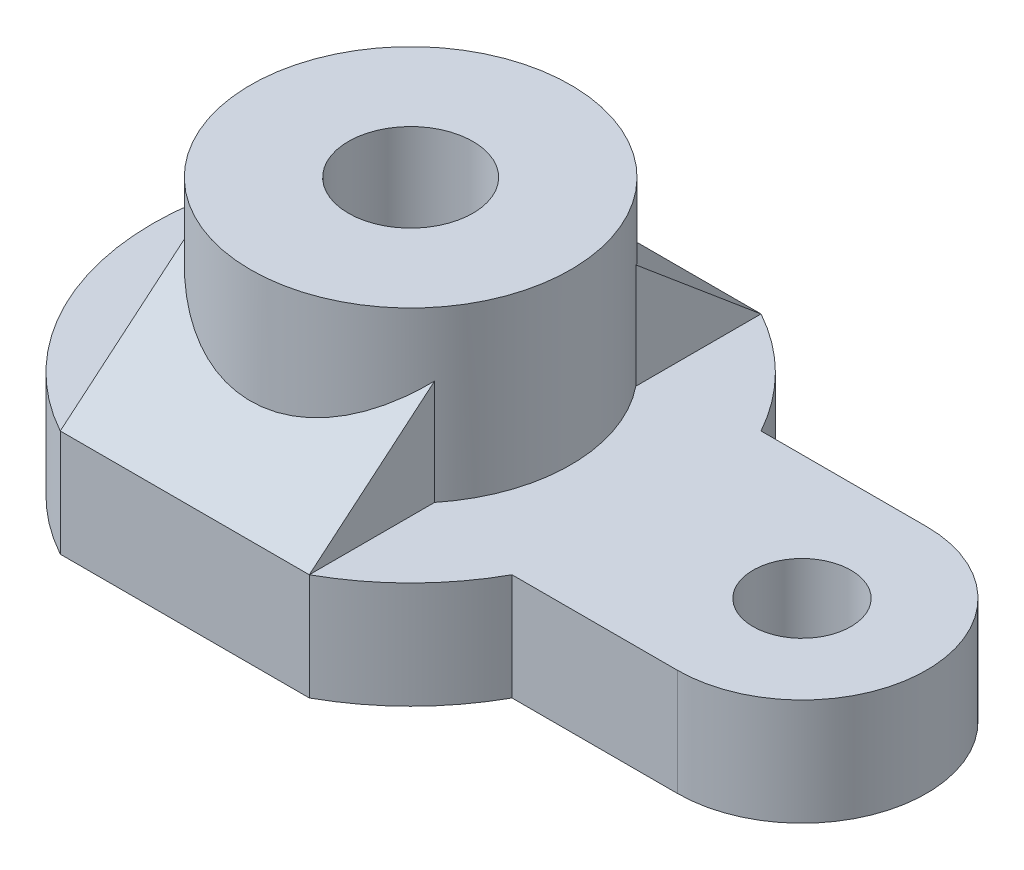
ISO-10303-21;
HEADER;
FILE_DESCRIPTION(('STEP AP214'),'2;1');
FILE_NAME('part.step','',(''),(''),'','','');
FILE_SCHEMA(('AUTOMOTIVE_DESIGN { 1 0 10303 214 1 1 1 1 }'));
ENDSEC;
DATA;
#1=APPLICATION_CONTEXT('core data for automotive mechanical design processes');
#2=APPLICATION_PROTOCOL_DEFINITION('international standard','automotive_design',2000,#1);
#3=PRODUCT_CONTEXT('',#1,'mechanical');
#4=PRODUCT('Part','Part','',(#3));
#5=PRODUCT_RELATED_PRODUCT_CATEGORY('part','',(#4));
#6=PRODUCT_DEFINITION_FORMATION('','',#4);
#7=PRODUCT_DEFINITION_CONTEXT('part definition',#1,'design');
#8=PRODUCT_DEFINITION('design','',#6,#7);
#9=PRODUCT_DEFINITION_SHAPE('','',#8);
#10=(LENGTH_UNIT() NAMED_UNIT(*) SI_UNIT(.MILLI.,.METRE.));
#11=(NAMED_UNIT(*) PLANE_ANGLE_UNIT() SI_UNIT($,.RADIAN.));
#12=(NAMED_UNIT(*) SI_UNIT($,.STERADIAN.) SOLID_ANGLE_UNIT());
#13=UNCERTAINTY_MEASURE_WITH_UNIT(LENGTH_MEASURE(1.E-05),#10,'distance_accuracy_value','');
#14=(GEOMETRIC_REPRESENTATION_CONTEXT(3) GLOBAL_UNCERTAINTY_ASSIGNED_CONTEXT((#13)) GLOBAL_UNIT_ASSIGNED_CONTEXT((#10,
#11,#12)) REPRESENTATION_CONTEXT('',''));
#15=CARTESIAN_POINT('',(0.,0.,0.));
#16=DIRECTION('',(0.,0.,1.));
#17=DIRECTION('',(1.,0.,0.));
#18=AXIS2_PLACEMENT_3D('',#15,#16,#17);
#19=CARTESIAN_POINT('',(0.,24.,0.));
#20=DIRECTION('',(0.,1.,0.));
#21=DIRECTION('',(0.,0.,1.));
#22=AXIS2_PLACEMENT_3D('',#19,#20,#21);
#23=PLANE('',#22);
#24=CARTESIAN_POINT('',(0.,24.,0.));
#25=DIRECTION('',(0.,1.,0.));
#26=DIRECTION('',(0.,0.,1.));
#27=AXIS2_PLACEMENT_3D('',#24,#25,#26);
#28=CIRCLE('',#27,58.);
#29=CARTESIAN_POINT('',(-28.,24.,-50.7937003968012));
#30=VERTEX_POINT('',#29);
#31=CARTESIAN_POINT('',(-28.,24.,50.7937003968012));
#32=VERTEX_POINT('',#31);
#33=EDGE_CURVE('E311',#30,#32,#28,.T.);
#34=ORIENTED_EDGE('',*,*,#33,.T.);
#35=DIRECTION('',(0.,0.,-1.));
#36=VECTOR('',#35,1.);
#37=CARTESIAN_POINT('',(-28.,24.,50.7937003968012));
#38=LINE('',#37,#36);
#39=CARTESIAN_POINT('',(-28.,24.,22.6274169979695));
#40=VERTEX_POINT('',#39);
#41=EDGE_CURVE('E205',#32,#40,#38,.T.);
#42=ORIENTED_EDGE('',*,*,#41,.T.);
#43=CARTESIAN_POINT('',(0.,24.,0.));
#44=DIRECTION('',(0.,1.,0.));
#45=DIRECTION('',(0.,0.,1.));
#46=AXIS2_PLACEMENT_3D('',#43,#44,#45);
#47=CIRCLE('',#46,36.);
#48=CARTESIAN_POINT('',(-28.,24.,-22.6274169979695));
#49=VERTEX_POINT('',#48);
#50=EDGE_CURVE('E202',#49,#40,#47,.T.);
#51=ORIENTED_EDGE('',*,*,#50,.F.);
#52=DIRECTION('',(0.,0.,1.));
#53=VECTOR('',#52,1.);
#54=CARTESIAN_POINT('',(-28.,24.,-50.7937003968012));
#55=LINE('',#54,#53);
#56=EDGE_CURVE('E215',#30,#49,#55,.T.);
#57=ORIENTED_EDGE('',*,*,#56,.F.);
#58=EDGE_LOOP('',(#34,#42,#51,#57));
#59=FACE_BOUND('',#58,.T.);
#60=ADVANCED_FACE('F91',(#59),#23,.T.);
#61=DIRECTION('',(0.,0.,-1.));
#62=VECTOR('',#61,1.);
#63=CARTESIAN_POINT('',(28.,24.,50.7937003968012));
#64=LINE('',#63,#62);
#65=CARTESIAN_POINT('',(28.,24.,50.7937003968012));
#66=VERTEX_POINT('',#65);
#67=CARTESIAN_POINT('',(28.,24.,22.6274169979695));
#68=VERTEX_POINT('',#67);
#69=EDGE_CURVE('E195',#66,#68,#64,.T.);
#70=ORIENTED_EDGE('',*,*,#69,.F.);
#71=CARTESIAN_POINT('',(0.,24.,0.));
#72=DIRECTION('',(0.,1.,0.));
#73=DIRECTION('',(0.,0.,1.));
#74=AXIS2_PLACEMENT_3D('',#71,#72,#73);
#75=CIRCLE('',#74,58.);
#76=CARTESIAN_POINT('',(50.7937003968012,24.,28.));
#77=VERTEX_POINT('',#76);
#78=EDGE_CURVE('E254',#66,#77,#75,.T.);
#79=ORIENTED_EDGE('',*,*,#78,.T.);
#80=DIRECTION('',(-1.,0.,0.));
#81=VECTOR('',#80,1.);
#82=CARTESIAN_POINT('',(0.,24.,28.));
#83=LINE('',#82,#81);
#84=CARTESIAN_POINT('',(88.,24.,28.));
#85=VERTEX_POINT('',#84);
#86=EDGE_CURVE('E250',#85,#77,#83,.T.);
#87=ORIENTED_EDGE('',*,*,#86,.F.);
#88=CARTESIAN_POINT('',(88.,24.,0.));
#89=DIRECTION('',(0.,1.,0.));
#90=DIRECTION('',(0.,0.,1.));
#91=AXIS2_PLACEMENT_3D('',#88,#89,#90);
#92=CIRCLE('',#91,28.);
#93=CARTESIAN_POINT('',(88.,24.,-28.));
#94=VERTEX_POINT('',#93);
#95=EDGE_CURVE('E253',#85,#94,#92,.T.);
#96=ORIENTED_EDGE('',*,*,#95,.T.);
#97=DIRECTION('',(-1.,0.,0.));
#98=VECTOR('',#97,1.);
#99=CARTESIAN_POINT('',(0.,24.,-28.));
#100=LINE('',#99,#98);
#101=CARTESIAN_POINT('',(50.7937003968012,24.,-28.));
#102=VERTEX_POINT('',#101);
#103=EDGE_CURVE('E256',#94,#102,#100,.T.);
#104=ORIENTED_EDGE('',*,*,#103,.T.);
#105=CARTESIAN_POINT('',(0.,24.,0.));
#106=DIRECTION('',(0.,1.,0.));
#107=DIRECTION('',(0.,0.,1.));
#108=AXIS2_PLACEMENT_3D('',#105,#106,#107);
#109=CIRCLE('',#108,58.);
#110=CARTESIAN_POINT('',(28.,24.,-50.7937003968012));
#111=VERTEX_POINT('',#110);
#112=EDGE_CURVE('E258',#102,#111,#109,.T.);
#113=ORIENTED_EDGE('',*,*,#112,.T.);
#114=DIRECTION('',(0.,0.,1.));
#115=VECTOR('',#114,1.);
#116=CARTESIAN_POINT('',(28.,24.,-50.7937003968012));
#117=LINE('',#116,#115);
#118=CARTESIAN_POINT('',(28.,24.,-22.6274169979695));
#119=VERTEX_POINT('',#118);
#120=EDGE_CURVE('E213',#111,#119,#117,.T.);
#121=ORIENTED_EDGE('',*,*,#120,.T.);
#122=EDGE_CURVE('E245',#68,#119,#47,.T.);
#123=ORIENTED_EDGE('',*,*,#122,.F.);
#124=EDGE_LOOP('',(#70,#79,#87,#96,#104,#113,#121,#123));
#125=FACE_BOUND('',#124,.T.);
#126=CARTESIAN_POINT('',(88.,24.,0.));
#127=DIRECTION('',(0.,1.,0.));
#128=DIRECTION('',(0.,0.,1.));
#129=AXIS2_PLACEMENT_3D('',#126,#127,#128);
#130=CIRCLE('',#129,11.);
#131=CARTESIAN_POINT('',(88.,24.,11.));
#132=VERTEX_POINT('',#131);
#133=EDGE_CURVE('E246',#132,#132,#130,.T.);
#134=ORIENTED_EDGE('',*,*,#133,.F.);
#135=EDGE_LOOP('',(#134));
#136=FACE_BOUND('',#135,.T.);
#137=ADVANCED_FACE('F358',(#125,#136),#23,.T.);
#138=CARTESIAN_POINT('',(0.,24.,50.7937003968012));
#139=DIRECTION('',(0.,0.,-1.));
#140=DIRECTION('',(-1.,0.,0.));
#141=AXIS2_PLACEMENT_3D('',#138,#139,#140);
#142=PLANE('',#141);
#143=DIRECTION('',(1.,0.,0.));
#144=VECTOR('',#143,1.);
#145=CARTESIAN_POINT('',(0.,0.,50.7937003968012));
#146=LINE('',#145,#144);
#147=CARTESIAN_POINT('',(-28.,0.,50.7937003968012));
#148=VERTEX_POINT('',#147);
#149=CARTESIAN_POINT('',(28.,0.,50.7937003968012));
#150=VERTEX_POINT('',#149);
#151=EDGE_CURVE('E261',#148,#150,#146,.T.);
#152=ORIENTED_EDGE('',*,*,#151,.T.);
#153=DIRECTION('',(0.,-1.,0.));
#154=VECTOR('',#153,1.);
#155=CARTESIAN_POINT('',(28.,24.,50.7937003968012));
#156=LINE('',#155,#154);
#157=EDGE_CURVE('E292',#66,#150,#156,.T.);
#158=ORIENTED_EDGE('',*,*,#157,.F.);
#159=DIRECTION('',(1.,0.,0.));
#160=VECTOR('',#159,1.);
#161=CARTESIAN_POINT('',(0.,24.,50.7937003968012));
#162=LINE('',#161,#160);
#163=EDGE_CURVE('E187',#32,#66,#162,.T.);
#164=ORIENTED_EDGE('',*,*,#163,.F.);
#165=DIRECTION('',(0.,-1.,0.));
#166=VECTOR('',#165,1.);
#167=CARTESIAN_POINT('',(-28.,24.,50.7937003968012));
#168=LINE('',#167,#166);
#169=EDGE_CURVE('E308',#32,#148,#168,.T.);
#170=ORIENTED_EDGE('',*,*,#169,.T.);
#171=EDGE_LOOP('',(#152,#158,#164,#170));
#172=FACE_BOUND('',#171,.T.);
#173=ADVANCED_FACE('F344',(#172),#142,.F.);
#174=CARTESIAN_POINT('',(0.,24.,0.));
#175=DIRECTION('',(0.,-1.,0.));
#176=DIRECTION('',(0.,0.,-1.));
#177=AXIS2_PLACEMENT_3D('',#174,#175,#176);
#178=CYLINDRICAL_SURFACE('',#177,58.);
#179=CARTESIAN_POINT('',(0.,0.,0.));
#180=DIRECTION('',(0.,1.,0.));
#181=DIRECTION('',(0.,0.,1.));
#182=AXIS2_PLACEMENT_3D('',#179,#180,#181);
#183=CIRCLE('',#182,58.);
#184=CARTESIAN_POINT('',(50.7937003968012,0.,28.));
#185=VERTEX_POINT('',#184);
#186=EDGE_CURVE('E264',#150,#185,#183,.T.);
#187=ORIENTED_EDGE('',*,*,#186,.T.);
#188=DIRECTION('',(0.,-1.,0.));
#189=VECTOR('',#188,1.);
#190=CARTESIAN_POINT('',(50.7937003968012,24.,28.));
#191=LINE('',#190,#189);
#192=EDGE_CURVE('E290',#77,#185,#191,.T.);
#193=ORIENTED_EDGE('',*,*,#192,.F.);
#194=ORIENTED_EDGE('',*,*,#78,.F.);
#195=ORIENTED_EDGE('',*,*,#157,.T.);
#196=EDGE_LOOP('',(#187,#193,#194,#195));
#197=FACE_BOUND('',#196,.T.);
#198=ADVANCED_FACE('F340',(#197),#178,.T.);
#199=CARTESIAN_POINT('',(0.,24.,28.));
#200=DIRECTION('',(0.,0.,1.));
#201=DIRECTION('',(1.,0.,0.));
#202=AXIS2_PLACEMENT_3D('',#199,#200,#201);
#203=PLANE('',#202);
#204=DIRECTION('',(-1.,0.,0.));
#205=VECTOR('',#204,1.);
#206=CARTESIAN_POINT('',(0.,0.,28.));
#207=LINE('',#206,#205);
#208=CARTESIAN_POINT('',(88.,0.,28.));
#209=VERTEX_POINT('',#208);
#210=EDGE_CURVE('E267',#209,#185,#207,.T.);
#211=ORIENTED_EDGE('',*,*,#210,.F.);
#212=DIRECTION('',(0.,-1.,0.));
#213=VECTOR('',#212,1.);
#214=CARTESIAN_POINT('',(88.,24.,28.));
#215=LINE('',#214,#213);
#216=EDGE_CURVE('E288',#85,#209,#215,.T.);
#217=ORIENTED_EDGE('',*,*,#216,.F.);
#218=ORIENTED_EDGE('',*,*,#86,.T.);
#219=ORIENTED_EDGE('',*,*,#192,.T.);
#220=EDGE_LOOP('',(#211,#217,#218,#219));
#221=FACE_BOUND('',#220,.T.);
#222=ADVANCED_FACE('F354',(#221),#203,.T.);
#223=CARTESIAN_POINT('',(88.,24.,0.));
#224=DIRECTION('',(0.,-1.,0.));
#225=DIRECTION('',(0.,0.,-1.));
#226=AXIS2_PLACEMENT_3D('',#223,#224,#225);
#227=CYLINDRICAL_SURFACE('',#226,28.);
#228=CARTESIAN_POINT('',(88.,0.,0.));
#229=DIRECTION('',(0.,1.,0.));
#230=DIRECTION('',(0.,0.,1.));
#231=AXIS2_PLACEMENT_3D('',#228,#229,#230);
#232=CIRCLE('',#231,28.);
#233=CARTESIAN_POINT('',(88.,0.,-28.));
#234=VERTEX_POINT('',#233);
#235=EDGE_CURVE('E270',#209,#234,#232,.T.);
#236=ORIENTED_EDGE('',*,*,#235,.T.);
#237=DIRECTION('',(0.,-1.,0.));
#238=VECTOR('',#237,1.);
#239=CARTESIAN_POINT('',(88.,24.,-28.));
#240=LINE('',#239,#238);
#241=EDGE_CURVE('E284',#94,#234,#240,.T.);
#242=ORIENTED_EDGE('',*,*,#241,.F.);
#243=ORIENTED_EDGE('',*,*,#95,.F.);
#244=ORIENTED_EDGE('',*,*,#216,.T.);
#245=EDGE_LOOP('',(#236,#242,#243,#244));
#246=FACE_BOUND('',#245,.T.);
#247=ADVANCED_FACE('F415',(#246),#227,.T.);
#248=CARTESIAN_POINT('',(0.,24.,-28.));
#249=DIRECTION('',(0.,0.,1.));
#250=DIRECTION('',(1.,0.,0.));
#251=AXIS2_PLACEMENT_3D('',#248,#249,#250);
#252=PLANE('',#251);
#253=DIRECTION('',(-1.,0.,0.));
#254=VECTOR('',#253,1.);
#255=CARTESIAN_POINT('',(0.,0.,-28.));
#256=LINE('',#255,#254);
#257=CARTESIAN_POINT('',(50.7937003968012,0.,-28.));
#258=VERTEX_POINT('',#257);
#259=EDGE_CURVE('E272',#234,#258,#256,.T.);
#260=ORIENTED_EDGE('',*,*,#259,.T.);
#261=DIRECTION('',(0.,-1.,0.));
#262=VECTOR('',#261,1.);
#263=CARTESIAN_POINT('',(50.7937003968012,24.,-28.));
#264=LINE('',#263,#262);
#265=EDGE_CURVE('E281',#102,#258,#264,.T.);
#266=ORIENTED_EDGE('',*,*,#265,.F.);
#267=ORIENTED_EDGE('',*,*,#103,.F.);
#268=ORIENTED_EDGE('',*,*,#241,.T.);
#269=EDGE_LOOP('',(#260,#266,#267,#268));
#270=FACE_BOUND('',#269,.T.);
#271=ADVANCED_FACE('F411',(#270),#252,.F.);
#272=CARTESIAN_POINT('',(0.,24.,0.));
#273=DIRECTION('',(0.,-1.,0.));
#274=DIRECTION('',(0.,0.,-1.));
#275=AXIS2_PLACEMENT_3D('',#272,#273,#274);
#276=CYLINDRICAL_SURFACE('',#275,58.);
#277=CARTESIAN_POINT('',(0.,0.,0.));
#278=DIRECTION('',(0.,1.,0.));
#279=DIRECTION('',(0.,0.,1.));
#280=AXIS2_PLACEMENT_3D('',#277,#278,#279);
#281=CIRCLE('',#280,58.);
#282=CARTESIAN_POINT('',(28.,0.,-50.7937003968012));
#283=VERTEX_POINT('',#282);
#284=EDGE_CURVE('E274',#258,#283,#281,.T.);
#285=ORIENTED_EDGE('',*,*,#284,.T.);
#286=DIRECTION('',(0.,-1.,0.));
#287=VECTOR('',#286,1.);
#288=CARTESIAN_POINT('',(28.,24.,-50.7937003968012));
#289=LINE('',#288,#287);
#290=EDGE_CURVE('E285',#111,#283,#289,.T.);
#291=ORIENTED_EDGE('',*,*,#290,.F.);
#292=ORIENTED_EDGE('',*,*,#112,.F.);
#293=ORIENTED_EDGE('',*,*,#265,.T.);
#294=EDGE_LOOP('',(#285,#291,#292,#293));
#295=FACE_BOUND('',#294,.T.);
#296=ADVANCED_FACE('F407',(#295),#276,.T.);
#297=CARTESIAN_POINT('',(0.,24.,-50.7937003968012));
#298=DIRECTION('',(0.,0.,-1.));
#299=DIRECTION('',(-1.,0.,0.));
#300=AXIS2_PLACEMENT_3D('',#297,#298,#299);
#301=PLANE('',#300);
#302=DIRECTION('',(1.,0.,0.));
#303=VECTOR('',#302,1.);
#304=CARTESIAN_POINT('',(0.,0.,-50.7937003968012));
#305=LINE('',#304,#303);
#306=CARTESIAN_POINT('',(-28.,0.,-50.7937003968012));
#307=VERTEX_POINT('',#306);
#308=EDGE_CURVE('E277',#307,#283,#305,.T.);
#309=ORIENTED_EDGE('',*,*,#308,.F.);
#310=DIRECTION('',(0.,-1.,0.));
#311=VECTOR('',#310,1.);
#312=CARTESIAN_POINT('',(-28.,24.,-50.7937003968012));
#313=LINE('',#312,#311);
#314=EDGE_CURVE('E306',#30,#307,#313,.T.);
#315=ORIENTED_EDGE('',*,*,#314,.F.);
#316=DIRECTION('',(1.,0.,0.));
#317=VECTOR('',#316,1.);
#318=CARTESIAN_POINT('',(0.,24.,-50.7937003968012));
#319=LINE('',#318,#317);
#320=EDGE_CURVE('E314',#30,#111,#319,.T.);
#321=ORIENTED_EDGE('',*,*,#320,.T.);
#322=ORIENTED_EDGE('',*,*,#290,.T.);
#323=EDGE_LOOP('',(#309,#315,#321,#322));
#324=FACE_BOUND('',#323,.T.);
#325=ADVANCED_FACE('F404',(#324),#301,.T.);
#326=CARTESIAN_POINT('',(88.,24.,0.));
#327=DIRECTION('',(0.,-1.,0.));
#328=DIRECTION('',(0.,0.,-1.));
#329=AXIS2_PLACEMENT_3D('',#326,#327,#328);
#330=CYLINDRICAL_SURFACE('',#329,11.);
#331=ORIENTED_EDGE('',*,*,#133,.T.);
#332=EDGE_LOOP('',(#331));
#333=FACE_BOUND('',#332,.T.);
#334=CARTESIAN_POINT('',(88.,0.,0.));
#335=DIRECTION('',(0.,1.,0.));
#336=DIRECTION('',(0.,0.,1.));
#337=AXIS2_PLACEMENT_3D('',#334,#335,#336);
#338=CIRCLE('',#337,11.);
#339=CARTESIAN_POINT('',(88.,0.,11.));
#340=VERTEX_POINT('',#339);
#341=EDGE_CURVE('E244',#340,#340,#338,.T.);
#342=ORIENTED_EDGE('',*,*,#341,.F.);
#343=EDGE_LOOP('',(#342));
#344=FACE_BOUND('',#343,.T.);
#345=ADVANCED_FACE('F93',(#333,#344),#330,.F.);
#346=CARTESIAN_POINT('',(0.,24.,0.));
#347=DIRECTION('',(0.,-1.,0.));
#348=DIRECTION('',(0.,0.,-1.));
#349=AXIS2_PLACEMENT_3D('',#346,#347,#348);
#350=CYLINDRICAL_SURFACE('',#349,58.);
#351=CARTESIAN_POINT('',(0.,0.,0.));
#352=DIRECTION('',(0.,1.,0.));
#353=DIRECTION('',(0.,0.,1.));
#354=AXIS2_PLACEMENT_3D('',#351,#352,#353);
#355=CIRCLE('',#354,58.);
#356=EDGE_CURVE('E249',#307,#148,#355,.T.);
#357=ORIENTED_EDGE('',*,*,#356,.T.);
#358=ORIENTED_EDGE('',*,*,#169,.F.);
#359=ORIENTED_EDGE('',*,*,#33,.F.);
#360=ORIENTED_EDGE('',*,*,#314,.T.);
#361=EDGE_LOOP('',(#357,#358,#359,#360));
#362=FACE_BOUND('',#361,.T.);
#363=ADVANCED_FACE('F399',(#362),#350,.T.);
#364=CARTESIAN_POINT('',(0.,0.,0.));
#365=DIRECTION('',(0.,1.,0.));
#366=DIRECTION('',(0.,0.,1.));
#367=AXIS2_PLACEMENT_3D('',#364,#365,#366);
#368=PLANE('',#367);
#369=ORIENTED_EDGE('',*,*,#341,.T.);
#370=EDGE_LOOP('',(#369));
#371=FACE_BOUND('',#370,.T.);
#372=ORIENTED_EDGE('',*,*,#151,.F.);
#373=ORIENTED_EDGE('',*,*,#356,.F.);
#374=ORIENTED_EDGE('',*,*,#308,.T.);
#375=ORIENTED_EDGE('',*,*,#284,.F.);
#376=ORIENTED_EDGE('',*,*,#259,.F.);
#377=ORIENTED_EDGE('',*,*,#235,.F.);
#378=ORIENTED_EDGE('',*,*,#210,.T.);
#379=ORIENTED_EDGE('',*,*,#186,.F.);
#380=EDGE_LOOP('',(#372,#373,#374,#375,#376,#377,#378,#379));
#381=FACE_BOUND('',#380,.T.);
#382=ADVANCED_FACE('F348',(#371,#381),#368,.F.);
#383=CARTESIAN_POINT('',(0.,62.,0.));
#384=DIRECTION('',(0.,1.,0.));
#385=DIRECTION('',(0.,0.,1.));
#386=AXIS2_PLACEMENT_3D('',#383,#384,#385);
#387=PLANE('',#386);
#388=CARTESIAN_POINT('',(0.,62.,0.));
#389=DIRECTION('',(0.,1.,0.));
#390=DIRECTION('',(0.,0.,1.));
#391=AXIS2_PLACEMENT_3D('',#388,#389,#390);
#392=CIRCLE('',#391,36.);
#393=CARTESIAN_POINT('',(0.,62.,36.));
#394=VERTEX_POINT('',#393);
#395=EDGE_CURVE('E241',#394,#394,#392,.T.);
#396=ORIENTED_EDGE('',*,*,#395,.T.);
#397=EDGE_LOOP('',(#396));
#398=FACE_BOUND('',#397,.T.);
#399=CARTESIAN_POINT('',(0.,62.,0.));
#400=DIRECTION('',(0.,1.,0.));
#401=DIRECTION('',(0.,0.,1.));
#402=AXIS2_PLACEMENT_3D('',#399,#400,#401);
#403=CIRCLE('',#402,14.);
#404=CARTESIAN_POINT('',(0.,62.,14.));
#405=VERTEX_POINT('',#404);
#406=EDGE_CURVE('E190',#405,#405,#403,.T.);
#407=ORIENTED_EDGE('',*,*,#406,.F.);
#408=EDGE_LOOP('',(#407));
#409=FACE_BOUND('',#408,.T.);
#410=ADVANCED_FACE('F398',(#398,#409),#387,.T.);
#411=CARTESIAN_POINT('',(0.,62.,0.));
#412=DIRECTION('',(0.,-1.,0.));
#413=DIRECTION('',(0.,0.,-1.));
#414=AXIS2_PLACEMENT_3D('',#411,#412,#413);
#415=CYLINDRICAL_SURFACE('',#414,36.);
#416=ORIENTED_EDGE('',*,*,#395,.F.);
#417=EDGE_LOOP('',(#416));
#418=FACE_BOUND('',#417,.T.);
#419=CARTESIAN_POINT('',(0.,66.6209752690853,0.));
#420=DIRECTION('',(0.,0.766044443118977,0.642787609686541));
#421=DIRECTION('',(0.,-0.642787609686541,0.766044443118977));
#422=AXIS2_PLACEMENT_3D('',#419,#420,#421);
#423=ELLIPSE('',#422,46.9946624159621,36.);
#424=CARTESIAN_POINT('',(-28.,47.6343180115945,22.6274169979695));
#425=VERTEX_POINT('',#424);
#426=CARTESIAN_POINT('',(28.,47.6343180115945,22.6274169979695));
#427=VERTEX_POINT('',#426);
#428=EDGE_CURVE('E12',#425,#427,#423,.T.);
#429=ORIENTED_EDGE('',*,*,#428,.T.);
#430=DIRECTION('',(0.,-1.,0.));
#431=VECTOR('',#430,1.);
#432=CARTESIAN_POINT('',(28.,47.6343180115945,22.6274169979695));
#433=LINE('',#432,#431);
#434=EDGE_CURVE('E193',#427,#68,#433,.T.);
#435=ORIENTED_EDGE('',*,*,#434,.T.);
#436=ORIENTED_EDGE('',*,*,#122,.T.);
#437=DIRECTION('',(0.,-1.,0.));
#438=VECTOR('',#437,1.);
#439=CARTESIAN_POINT('',(28.,47.6343180115945,-22.6274169979695));
#440=LINE('',#439,#438);
#441=CARTESIAN_POINT('',(28.,47.6343180115945,-22.6274169979695));
#442=VERTEX_POINT('',#441);
#443=EDGE_CURVE('E116',#442,#119,#440,.T.);
#444=ORIENTED_EDGE('',*,*,#443,.F.);
#445=CARTESIAN_POINT('',(0.,66.6209752690853,0.));
#446=DIRECTION('',(0.,-0.766044443118977,0.642787609686541));
#447=DIRECTION('',(0.,-0.642787609686541,-0.766044443118977));
#448=AXIS2_PLACEMENT_3D('',#445,#446,#447);
#449=ELLIPSE('',#448,46.9946624159621,36.);
#450=CARTESIAN_POINT('',(-28.,47.6343180115945,-22.6274169979695));
#451=VERTEX_POINT('',#450);
#452=EDGE_CURVE('E100',#451,#442,#449,.T.);
#453=ORIENTED_EDGE('',*,*,#452,.F.);
#454=DIRECTION('',(0.,-1.,0.));
#455=VECTOR('',#454,1.);
#456=CARTESIAN_POINT('',(-28.,47.6343180115945,-22.6274169979695));
#457=LINE('',#456,#455);
#458=EDGE_CURVE('E221',#451,#49,#457,.T.);
#459=ORIENTED_EDGE('',*,*,#458,.T.);
#460=ORIENTED_EDGE('',*,*,#50,.T.);
#461=DIRECTION('',(0.,-1.,0.));
#462=VECTOR('',#461,1.);
#463=CARTESIAN_POINT('',(-28.,47.6343180115945,22.6274169979695));
#464=LINE('',#463,#462);
#465=EDGE_CURVE('E197',#425,#40,#464,.T.);
#466=ORIENTED_EDGE('',*,*,#465,.F.);
#467=EDGE_LOOP('',(#429,#435,#436,#444,#453,#459,#460,#466));
#468=FACE_BOUND('',#467,.T.);
#469=ADVANCED_FACE('F199',(#418,#468),#415,.T.);
#470=CARTESIAN_POINT('',(0.,62.,0.));
#471=DIRECTION('',(0.,-1.,0.));
#472=DIRECTION('',(0.,0.,-1.));
#473=AXIS2_PLACEMENT_3D('',#470,#471,#472);
#474=CYLINDRICAL_SURFACE('',#473,14.);
#475=ORIENTED_EDGE('',*,*,#406,.T.);
#476=EDGE_LOOP('',(#475));
#477=FACE_BOUND('',#476,.T.);
#478=CARTESIAN_POINT('',(0.,24.,0.));
#479=DIRECTION('',(0.,1.,0.));
#480=DIRECTION('',(0.,0.,1.));
#481=AXIS2_PLACEMENT_3D('',#478,#479,#480);
#482=CIRCLE('',#481,14.);
#483=CARTESIAN_POINT('',(0.,24.,14.));
#484=VERTEX_POINT('',#483);
#485=EDGE_CURVE('E293',#484,#484,#482,.F.);
#486=ORIENTED_EDGE('',*,*,#485,.T.);
#487=EDGE_LOOP('',(#486));
#488=FACE_BOUND('',#487,.T.);
#489=ADVANCED_FACE('F383',(#477,#488),#474,.F.);
#490=ORIENTED_EDGE('',*,*,#485,.F.);
#491=EDGE_LOOP('',(#490));
#492=FACE_BOUND('',#491,.T.);
#493=ADVANCED_FACE('F375',(#492),#23,.T.);
#494=CARTESIAN_POINT('',(-28.,0.,0.));
#495=DIRECTION('',(1.,0.,0.));
#496=DIRECTION('',(0.,0.,-1.));
#497=AXIS2_PLACEMENT_3D('',#494,#495,#496);
#498=PLANE('',#497);
#499=ORIENTED_EDGE('',*,*,#56,.T.);
#500=ORIENTED_EDGE('',*,*,#458,.F.);
#501=DIRECTION('',(0.,0.64278760968654,0.766044443118977));
#502=VECTOR('',#501,1.);
#503=CARTESIAN_POINT('',(-28.,24.,-50.7937003968012));
#504=LINE('',#503,#502);
#505=EDGE_CURVE('E222',#30,#451,#504,.T.);
#506=ORIENTED_EDGE('',*,*,#505,.F.);
#507=EDGE_LOOP('',(#499,#500,#506));
#508=FACE_BOUND('',#507,.T.);
#509=ADVANCED_FACE('F373',(#508),#498,.F.);
#510=CARTESIAN_POINT('',(28.,0.,0.));
#511=DIRECTION('',(1.,0.,0.));
#512=DIRECTION('',(0.,0.,-1.));
#513=AXIS2_PLACEMENT_3D('',#510,#511,#512);
#514=PLANE('',#513);
#515=ORIENTED_EDGE('',*,*,#120,.F.);
#516=DIRECTION('',(0.,0.64278760968654,0.766044443118977));
#517=VECTOR('',#516,1.);
#518=CARTESIAN_POINT('',(28.,24.,-50.7937003968012));
#519=LINE('',#518,#517);
#520=EDGE_CURVE('E218',#111,#442,#519,.T.);
#521=ORIENTED_EDGE('',*,*,#520,.T.);
#522=ORIENTED_EDGE('',*,*,#443,.T.);
#523=EDGE_LOOP('',(#515,#521,#522));
#524=FACE_BOUND('',#523,.T.);
#525=ADVANCED_FACE('F363',(#524),#514,.T.);
#526=CARTESIAN_POINT('',(28.,24.,-50.7937003968012));
#527=DIRECTION('',(0.,-0.766044443118977,0.642787609686541));
#528=DIRECTION('',(0.,-0.642787609686541,-0.766044443118977));
#529=AXIS2_PLACEMENT_3D('',#526,#527,#528);
#530=PLANE('',#529);
#531=ORIENTED_EDGE('',*,*,#505,.T.);
#532=ORIENTED_EDGE('',*,*,#452,.T.);
#533=ORIENTED_EDGE('',*,*,#520,.F.);
#534=ORIENTED_EDGE('',*,*,#320,.F.);
#535=EDGE_LOOP('',(#531,#532,#533,#534));
#536=FACE_BOUND('',#535,.T.);
#537=ADVANCED_FACE('F367',(#536),#530,.F.);
#538=CARTESIAN_POINT('',(-28.,0.,0.));
#539=DIRECTION('',(1.,0.,0.));
#540=DIRECTION('',(0.,0.,-1.));
#541=AXIS2_PLACEMENT_3D('',#538,#539,#540);
#542=PLANE('',#541);
#543=DIRECTION('',(0.,0.64278760968654,-0.766044443118977));
#544=VECTOR('',#543,1.);
#545=CARTESIAN_POINT('',(-28.,24.,50.7937003968012));
#546=LINE('',#545,#544);
#547=EDGE_CURVE('E108',#32,#425,#546,.T.);
#548=ORIENTED_EDGE('',*,*,#547,.T.);
#549=ORIENTED_EDGE('',*,*,#465,.T.);
#550=ORIENTED_EDGE('',*,*,#41,.F.);
#551=EDGE_LOOP('',(#548,#549,#550));
#552=FACE_BOUND('',#551,.T.);
#553=ADVANCED_FACE('F500',(#552),#542,.F.);
#554=CARTESIAN_POINT('',(28.,0.,0.));
#555=DIRECTION('',(1.,0.,0.));
#556=DIRECTION('',(0.,0.,-1.));
#557=AXIS2_PLACEMENT_3D('',#554,#555,#556);
#558=PLANE('',#557);
#559=DIRECTION('',(0.,0.64278760968654,-0.766044443118977));
#560=VECTOR('',#559,1.);
#561=CARTESIAN_POINT('',(28.,24.,50.7937003968012));
#562=LINE('',#561,#560);
#563=EDGE_CURVE('E182',#66,#427,#562,.T.);
#564=ORIENTED_EDGE('',*,*,#563,.F.);
#565=ORIENTED_EDGE('',*,*,#69,.T.);
#566=ORIENTED_EDGE('',*,*,#434,.F.);
#567=EDGE_LOOP('',(#564,#565,#566));
#568=FACE_BOUND('',#567,.T.);
#569=ADVANCED_FACE('F194',(#568),#558,.T.);
#570=CARTESIAN_POINT('',(28.,24.,50.7937003968012));
#571=DIRECTION('',(0.,0.766044443118977,0.642787609686541));
#572=DIRECTION('',(0.,-0.642787609686541,0.766044443118977));
#573=AXIS2_PLACEMENT_3D('',#570,#571,#572);
#574=PLANE('',#573);
#575=ORIENTED_EDGE('',*,*,#428,.F.);
#576=ORIENTED_EDGE('',*,*,#547,.F.);
#577=ORIENTED_EDGE('',*,*,#163,.T.);
#578=ORIENTED_EDGE('',*,*,#563,.T.);
#579=EDGE_LOOP('',(#575,#576,#577,#578));
#580=FACE_BOUND('',#579,.T.);
#581=ADVANCED_FACE('F184',(#580),#574,.T.);
#582=CLOSED_SHELL('',(#60,#137,#173,#198,#222,#247,#271,#296,#325,#345,#363,#382,#410,#469,#489,
#493,#509,#525,#537,#553,#569,#581));
#583=MANIFOLD_SOLID_BREP('B2',#582);
#584=ADVANCED_BREP_SHAPE_REPRESENTATION('',(#18,#583),#14);
#585=SHAPE_DEFINITION_REPRESENTATION(#9,#584);
ENDSEC;
END-ISO-10303-21;
